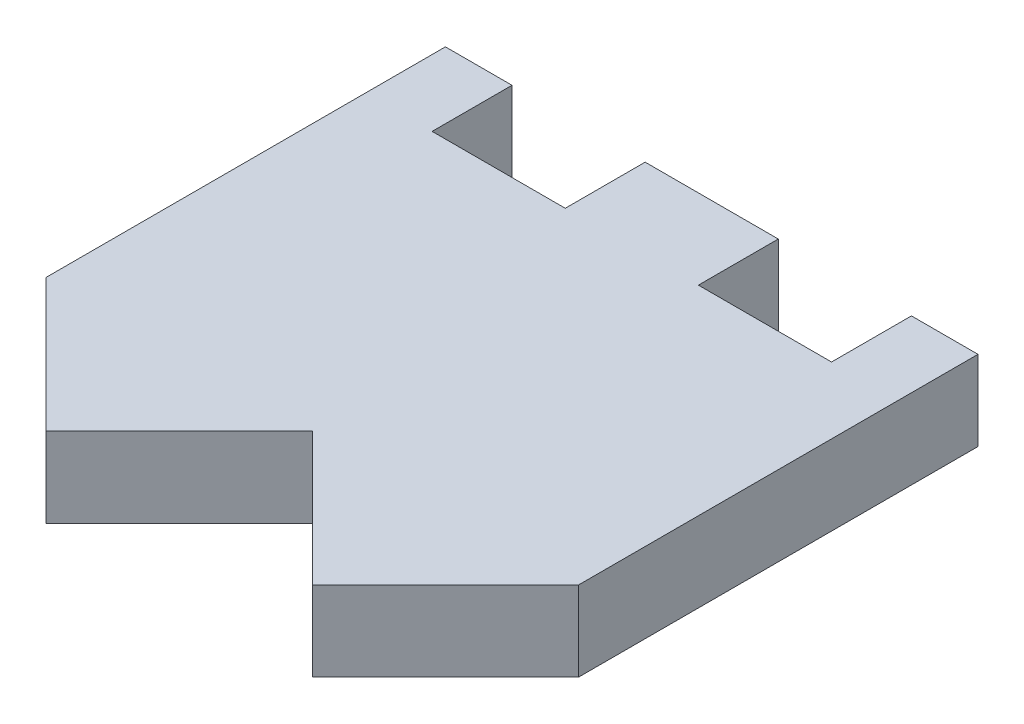
ISO-10303-21;
HEADER;
FILE_DESCRIPTION(('STEP AP214'),'2;1');
FILE_NAME('part.step','',(''),(''),'','','');
FILE_SCHEMA(('AUTOMOTIVE_DESIGN { 1 0 10303 214 1 1 1 1 }'));
ENDSEC;
DATA;
#1=APPLICATION_CONTEXT('core data for automotive mechanical design processes');
#2=APPLICATION_PROTOCOL_DEFINITION('international standard','automotive_design',2000,#1);
#3=PRODUCT_CONTEXT('',#1,'mechanical');
#4=PRODUCT('Part','Part','',(#3));
#5=PRODUCT_RELATED_PRODUCT_CATEGORY('part','',(#4));
#6=PRODUCT_DEFINITION_FORMATION('','',#4);
#7=PRODUCT_DEFINITION_CONTEXT('part definition',#1,'design');
#8=PRODUCT_DEFINITION('design','',#6,#7);
#9=PRODUCT_DEFINITION_SHAPE('','',#8);
#10=(LENGTH_UNIT() NAMED_UNIT(*) SI_UNIT(.MILLI.,.METRE.));
#11=(NAMED_UNIT(*) PLANE_ANGLE_UNIT() SI_UNIT($,.RADIAN.));
#12=(NAMED_UNIT(*) SI_UNIT($,.STERADIAN.) SOLID_ANGLE_UNIT());
#13=UNCERTAINTY_MEASURE_WITH_UNIT(LENGTH_MEASURE(1.E-05),#10,'distance_accuracy_value','');
#14=(GEOMETRIC_REPRESENTATION_CONTEXT(3) GLOBAL_UNCERTAINTY_ASSIGNED_CONTEXT((#13)) GLOBAL_UNIT_ASSIGNED_CONTEXT((#10,
#11,#12)) REPRESENTATION_CONTEXT('',''));
#15=CARTESIAN_POINT('',(0.,0.,0.));
#16=DIRECTION('',(0.,0.,1.));
#17=DIRECTION('',(1.,0.,0.));
#18=AXIS2_PLACEMENT_3D('',#15,#16,#17);
#19=CARTESIAN_POINT('',(0.,3.,0.));
#20=DIRECTION('',(0.,-1.,0.));
#21=DIRECTION('',(0.,0.,-1.));
#22=AXIS2_PLACEMENT_3D('',#19,#20,#21);
#23=PLANE('',#22);
#24=DIRECTION('',(0.,0.,-1.));
#25=VECTOR('',#24,1.);
#26=CARTESIAN_POINT('',(7.49999999999999,3.,0.));
#27=LINE('',#26,#25);
#28=CARTESIAN_POINT('',(7.5,3.,-7.));
#29=VERTEX_POINT('',#28);
#30=CARTESIAN_POINT('',(7.5,3.,-10.));
#31=VERTEX_POINT('',#30);
#32=EDGE_CURVE('E222',#29,#31,#27,.T.);
#33=ORIENTED_EDGE('',*,*,#32,.F.);
#34=DIRECTION('',(1.,0.,0.));
#35=VECTOR('',#34,1.);
#36=CARTESIAN_POINT('',(0.,3.,-7.));
#37=LINE('',#36,#35);
#38=CARTESIAN_POINT('',(2.5,3.,-7.));
#39=VERTEX_POINT('',#38);
#40=EDGE_CURVE('E322',#39,#29,#37,.T.);
#41=ORIENTED_EDGE('',*,*,#40,.F.);
#42=DIRECTION('',(0.,0.,1.));
#43=VECTOR('',#42,1.);
#44=CARTESIAN_POINT('',(2.5,3.,0.));
#45=LINE('',#44,#43);
#46=CARTESIAN_POINT('',(2.5,3.,-10.));
#47=VERTEX_POINT('',#46);
#48=EDGE_CURVE('E325',#47,#39,#45,.T.);
#49=ORIENTED_EDGE('',*,*,#48,.F.);
#50=DIRECTION('',(-1.,0.,0.));
#51=VECTOR('',#50,1.);
#52=CARTESIAN_POINT('',(-10.,3.,-10.));
#53=LINE('',#52,#51);
#54=CARTESIAN_POINT('',(-2.5,3.,-10.));
#55=VERTEX_POINT('',#54);
#56=EDGE_CURVE('E129',#47,#55,#53,.T.);
#57=ORIENTED_EDGE('',*,*,#56,.T.);
#58=DIRECTION('',(0.,0.,1.));
#59=VECTOR('',#58,1.);
#60=CARTESIAN_POINT('',(-2.5,3.,0.));
#61=LINE('',#60,#59);
#62=CARTESIAN_POINT('',(-2.5,3.,-7.));
#63=VERTEX_POINT('',#62);
#64=EDGE_CURVE('E300',#55,#63,#61,.T.);
#65=ORIENTED_EDGE('',*,*,#64,.T.);
#66=DIRECTION('',(-1.,0.,0.));
#67=VECTOR('',#66,1.);
#68=CARTESIAN_POINT('',(0.,3.,-7.));
#69=LINE('',#68,#67);
#70=CARTESIAN_POINT('',(-7.5,3.,-7.));
#71=VERTEX_POINT('',#70);
#72=EDGE_CURVE('E294',#63,#71,#69,.T.);
#73=ORIENTED_EDGE('',*,*,#72,.T.);
#74=DIRECTION('',(0.,0.,-1.));
#75=VECTOR('',#74,1.);
#76=CARTESIAN_POINT('',(-7.49999999999999,3.,0.));
#77=LINE('',#76,#75);
#78=CARTESIAN_POINT('',(-7.5,3.,-10.));
#79=VERTEX_POINT('',#78);
#80=EDGE_CURVE('E297',#71,#79,#77,.T.);
#81=ORIENTED_EDGE('',*,*,#80,.T.);
#82=CARTESIAN_POINT('',(-10.,3.,-10.));
#83=VERTEX_POINT('',#82);
#84=EDGE_CURVE('E264',#79,#83,#53,.T.);
#85=ORIENTED_EDGE('',*,*,#84,.T.);
#86=DIRECTION('',(0.,0.,1.));
#87=VECTOR('',#86,1.);
#88=CARTESIAN_POINT('',(-10.,3.,10.));
#89=LINE('',#88,#87);
#90=CARTESIAN_POINT('',(-10.,3.,4.99999999999999));
#91=VERTEX_POINT('',#90);
#92=EDGE_CURVE('E259',#83,#91,#89,.T.);
#93=ORIENTED_EDGE('',*,*,#92,.T.);
#94=DIRECTION('',(-0.707106781186548,0.,-0.707106781186548));
#95=VECTOR('',#94,1.);
#96=CARTESIAN_POINT('',(-7.5,3.,7.5));
#97=LINE('',#96,#95);
#98=CARTESIAN_POINT('',(-5.,3.,10.));
#99=VERTEX_POINT('',#98);
#100=EDGE_CURVE('E253',#99,#91,#97,.T.);
#101=ORIENTED_EDGE('',*,*,#100,.F.);
#102=DIRECTION('',(-0.707106781186547,0.,0.707106781186548));
#103=VECTOR('',#102,1.);
#104=CARTESIAN_POINT('',(2.5,3.,2.5));
#105=LINE('',#104,#103);
#106=CARTESIAN_POINT('',(0.,3.,5.));
#107=VERTEX_POINT('',#106);
#108=EDGE_CURVE('E283',#107,#99,#105,.T.);
#109=ORIENTED_EDGE('',*,*,#108,.F.);
#110=DIRECTION('',(-0.707106781186548,0.,-0.707106781186547));
#111=VECTOR('',#110,1.);
#112=CARTESIAN_POINT('',(-2.5,3.,2.5));
#113=LINE('',#112,#111);
#114=CARTESIAN_POINT('',(5.,3.,9.99999999999999));
#115=VERTEX_POINT('',#114);
#116=EDGE_CURVE('E274',#115,#107,#113,.T.);
#117=ORIENTED_EDGE('',*,*,#116,.F.);
#118=DIRECTION('',(-0.707106781186548,0.,0.707106781186548));
#119=VECTOR('',#118,1.);
#120=CARTESIAN_POINT('',(7.5,3.,7.5));
#121=LINE('',#120,#119);
#122=CARTESIAN_POINT('',(10.,3.,5.));
#123=VERTEX_POINT('',#122);
#124=EDGE_CURVE('E256',#123,#115,#121,.T.);
#125=ORIENTED_EDGE('',*,*,#124,.F.);
#126=DIRECTION('',(0.,0.,-1.));
#127=VECTOR('',#126,1.);
#128=CARTESIAN_POINT('',(10.,3.,10.));
#129=LINE('',#128,#127);
#130=CARTESIAN_POINT('',(10.,3.,-10.));
#131=VERTEX_POINT('',#130);
#132=EDGE_CURVE('E244',#123,#131,#129,.T.);
#133=ORIENTED_EDGE('',*,*,#132,.T.);
#134=EDGE_CURVE('E262',#131,#31,#53,.T.);
#135=ORIENTED_EDGE('',*,*,#134,.T.);
#136=EDGE_LOOP('',(#33,#41,#49,#57,#65,#73,#81,#85,#93,#101,#109,#117,#125,#133,#135));
#137=FACE_BOUND('',#136,.T.);
#138=ADVANCED_FACE('F106',(#137),#23,.F.);
#139=CARTESIAN_POINT('',(0.,0.,0.));
#140=DIRECTION('',(0.,-1.,0.));
#141=DIRECTION('',(0.,0.,-1.));
#142=AXIS2_PLACEMENT_3D('',#139,#140,#141);
#143=PLANE('',#142);
#144=DIRECTION('',(-1.,0.,0.));
#145=VECTOR('',#144,1.);
#146=CARTESIAN_POINT('',(7.5,0.,-7.));
#147=LINE('',#146,#145);
#148=CARTESIAN_POINT('',(7.5,0.,-7.));
#149=VERTEX_POINT('',#148);
#150=CARTESIAN_POINT('',(2.5,0.,-7.));
#151=VERTEX_POINT('',#150);
#152=EDGE_CURVE('E228',#149,#151,#147,.T.);
#153=ORIENTED_EDGE('',*,*,#152,.F.);
#154=DIRECTION('',(0.,0.,1.));
#155=VECTOR('',#154,1.);
#156=CARTESIAN_POINT('',(7.5,0.,-10.));
#157=LINE('',#156,#155);
#158=CARTESIAN_POINT('',(7.5,0.,-10.));
#159=VERTEX_POINT('',#158);
#160=EDGE_CURVE('E219',#159,#149,#157,.T.);
#161=ORIENTED_EDGE('',*,*,#160,.F.);
#162=DIRECTION('',(-1.,0.,0.));
#163=VECTOR('',#162,1.);
#164=CARTESIAN_POINT('',(-10.,0.,-10.));
#165=LINE('',#164,#163);
#166=CARTESIAN_POINT('',(10.,0.,-10.));
#167=VERTEX_POINT('',#166);
#168=EDGE_CURVE('E235',#167,#159,#165,.T.);
#169=ORIENTED_EDGE('',*,*,#168,.F.);
#170=DIRECTION('',(0.,0.,-1.));
#171=VECTOR('',#170,1.);
#172=CARTESIAN_POINT('',(10.,0.,10.));
#173=LINE('',#172,#171);
#174=CARTESIAN_POINT('',(10.,0.,5.));
#175=VERTEX_POINT('',#174);
#176=EDGE_CURVE('E247',#175,#167,#173,.T.);
#177=ORIENTED_EDGE('',*,*,#176,.F.);
#178=DIRECTION('',(0.707106781186548,0.,-0.707106781186548));
#179=VECTOR('',#178,1.);
#180=CARTESIAN_POINT('',(7.5,0.,7.5));
#181=LINE('',#180,#179);
#182=CARTESIAN_POINT('',(5.,0.,9.99999999999999));
#183=VERTEX_POINT('',#182);
#184=EDGE_CURVE('E272',#183,#175,#181,.T.);
#185=ORIENTED_EDGE('',*,*,#184,.F.);
#186=DIRECTION('',(0.707106781186548,0.,0.707106781186547));
#187=VECTOR('',#186,1.);
#188=CARTESIAN_POINT('',(-2.5,0.,2.5));
#189=LINE('',#188,#187);
#190=CARTESIAN_POINT('',(0.,0.,5.));
#191=VERTEX_POINT('',#190);
#192=EDGE_CURVE('E292',#191,#183,#189,.T.);
#193=ORIENTED_EDGE('',*,*,#192,.F.);
#194=DIRECTION('',(0.707106781186547,0.,-0.707106781186548));
#195=VECTOR('',#194,1.);
#196=CARTESIAN_POINT('',(2.5,0.,2.5));
#197=LINE('',#196,#195);
#198=CARTESIAN_POINT('',(-5.,0.,10.));
#199=VERTEX_POINT('',#198);
#200=EDGE_CURVE('E289',#199,#191,#197,.T.);
#201=ORIENTED_EDGE('',*,*,#200,.F.);
#202=DIRECTION('',(0.707106781186548,0.,0.707106781186548));
#203=VECTOR('',#202,1.);
#204=CARTESIAN_POINT('',(-7.5,0.,7.5));
#205=LINE('',#204,#203);
#206=CARTESIAN_POINT('',(-10.,0.,4.99999999999999));
#207=VERTEX_POINT('',#206);
#208=EDGE_CURVE('E271',#207,#199,#205,.T.);
#209=ORIENTED_EDGE('',*,*,#208,.F.);
#210=DIRECTION('',(0.,0.,1.));
#211=VECTOR('',#210,1.);
#212=CARTESIAN_POINT('',(-10.,0.,10.));
#213=LINE('',#212,#211);
#214=CARTESIAN_POINT('',(-10.,0.,-10.));
#215=VERTEX_POINT('',#214);
#216=EDGE_CURVE('E239',#215,#207,#213,.T.);
#217=ORIENTED_EDGE('',*,*,#216,.F.);
#218=CARTESIAN_POINT('',(-7.5,0.,-10.));
#219=VERTEX_POINT('',#218);
#220=EDGE_CURVE('E242',#219,#215,#165,.T.);
#221=ORIENTED_EDGE('',*,*,#220,.F.);
#222=DIRECTION('',(0.,0.,1.));
#223=VECTOR('',#222,1.);
#224=CARTESIAN_POINT('',(-7.5,0.,-10.));
#225=LINE('',#224,#223);
#226=CARTESIAN_POINT('',(-7.5,0.,-7.));
#227=VERTEX_POINT('',#226);
#228=EDGE_CURVE('E319',#219,#227,#225,.T.);
#229=ORIENTED_EDGE('',*,*,#228,.T.);
#230=DIRECTION('',(1.,0.,0.));
#231=VECTOR('',#230,1.);
#232=CARTESIAN_POINT('',(-7.5,0.,-7.));
#233=LINE('',#232,#231);
#234=CARTESIAN_POINT('',(-2.5,0.,-7.));
#235=VERTEX_POINT('',#234);
#236=EDGE_CURVE('E316',#227,#235,#233,.T.);
#237=ORIENTED_EDGE('',*,*,#236,.T.);
#238=DIRECTION('',(0.,0.,-1.));
#239=VECTOR('',#238,1.);
#240=CARTESIAN_POINT('',(-2.5,0.,-10.));
#241=LINE('',#240,#239);
#242=CARTESIAN_POINT('',(-2.5,0.,-10.));
#243=VERTEX_POINT('',#242);
#244=EDGE_CURVE('E307',#235,#243,#241,.T.);
#245=ORIENTED_EDGE('',*,*,#244,.T.);
#246=CARTESIAN_POINT('',(2.5,0.,-10.));
#247=VERTEX_POINT('',#246);
#248=EDGE_CURVE('E240',#247,#243,#165,.T.);
#249=ORIENTED_EDGE('',*,*,#248,.F.);
#250=DIRECTION('',(0.,0.,-1.));
#251=VECTOR('',#250,1.);
#252=CARTESIAN_POINT('',(2.5,0.,-10.));
#253=LINE('',#252,#251);
#254=EDGE_CURVE('E121',#151,#247,#253,.T.);
#255=ORIENTED_EDGE('',*,*,#254,.F.);
#256=EDGE_LOOP('',(#153,#161,#169,#177,#185,#193,#201,#209,#217,#221,#229,#237,#245,#249,#255));
#257=FACE_BOUND('',#256,.T.);
#258=ADVANCED_FACE('F233',(#257),#143,.T.);
#259=CARTESIAN_POINT('',(-10.,3.,-10.));
#260=DIRECTION('',(0.,0.,1.));
#261=DIRECTION('',(1.,0.,0.));
#262=AXIS2_PLACEMENT_3D('',#259,#260,#261);
#263=PLANE('',#262);
#264=DIRECTION('',(0.,1.,0.));
#265=VECTOR('',#264,1.);
#266=CARTESIAN_POINT('',(7.5,0.,-10.));
#267=LINE('',#266,#265);
#268=EDGE_CURVE('E215',#159,#31,#267,.T.);
#269=ORIENTED_EDGE('',*,*,#268,.T.);
#270=ORIENTED_EDGE('',*,*,#134,.F.);
#271=DIRECTION('',(0.,-1.,0.));
#272=VECTOR('',#271,1.);
#273=CARTESIAN_POINT('',(10.,3.,-10.));
#274=LINE('',#273,#272);
#275=EDGE_CURVE('E12',#131,#167,#274,.T.);
#276=ORIENTED_EDGE('',*,*,#275,.T.);
#277=ORIENTED_EDGE('',*,*,#168,.T.);
#278=EDGE_LOOP('',(#269,#270,#276,#277));
#279=FACE_BOUND('',#278,.T.);
#280=ADVANCED_FACE('F237',(#279),#263,.F.);
#281=DIRECTION('',(0.,1.,0.));
#282=VECTOR('',#281,1.);
#283=CARTESIAN_POINT('',(2.5,0.,-10.));
#284=LINE('',#283,#282);
#285=EDGE_CURVE('E227',#247,#47,#284,.T.);
#286=ORIENTED_EDGE('',*,*,#285,.F.);
#287=ORIENTED_EDGE('',*,*,#248,.T.);
#288=DIRECTION('',(0.,1.,0.));
#289=VECTOR('',#288,1.);
#290=CARTESIAN_POINT('',(-2.5,0.,-10.));
#291=LINE('',#290,#289);
#292=EDGE_CURVE('E310',#243,#55,#291,.T.);
#293=ORIENTED_EDGE('',*,*,#292,.T.);
#294=ORIENTED_EDGE('',*,*,#56,.F.);
#295=EDGE_LOOP('',(#286,#287,#293,#294));
#296=FACE_BOUND('',#295,.T.);
#297=ADVANCED_FACE('F342',(#296),#263,.F.);
#298=ORIENTED_EDGE('',*,*,#84,.F.);
#299=DIRECTION('',(0.,1.,0.));
#300=VECTOR('',#299,1.);
#301=CARTESIAN_POINT('',(-7.5,0.,-10.));
#302=LINE('',#301,#300);
#303=EDGE_CURVE('E302',#219,#79,#302,.T.);
#304=ORIENTED_EDGE('',*,*,#303,.F.);
#305=ORIENTED_EDGE('',*,*,#220,.T.);
#306=DIRECTION('',(0.,-1.,0.));
#307=VECTOR('',#306,1.);
#308=CARTESIAN_POINT('',(-10.,3.,-10.));
#309=LINE('',#308,#307);
#310=EDGE_CURVE('E114',#83,#215,#309,.T.);
#311=ORIENTED_EDGE('',*,*,#310,.F.);
#312=EDGE_LOOP('',(#298,#304,#305,#311));
#313=FACE_BOUND('',#312,.T.);
#314=ADVANCED_FACE('F351',(#313),#263,.F.);
#315=CARTESIAN_POINT('',(10.,3.,10.));
#316=DIRECTION('',(-1.,0.,0.));
#317=DIRECTION('',(0.,0.,1.));
#318=AXIS2_PLACEMENT_3D('',#315,#316,#317);
#319=PLANE('',#318);
#320=DIRECTION('',(0.,1.,0.));
#321=VECTOR('',#320,1.);
#322=CARTESIAN_POINT('',(10.,0.,5.));
#323=LINE('',#322,#321);
#324=EDGE_CURVE('E269',#175,#123,#323,.T.);
#325=ORIENTED_EDGE('',*,*,#324,.F.);
#326=ORIENTED_EDGE('',*,*,#176,.T.);
#327=ORIENTED_EDGE('',*,*,#275,.F.);
#328=ORIENTED_EDGE('',*,*,#132,.F.);
#329=EDGE_LOOP('',(#325,#326,#327,#328));
#330=FACE_BOUND('',#329,.T.);
#331=ADVANCED_FACE('F108',(#330),#319,.F.);
#332=CARTESIAN_POINT('',(-10.,3.,10.));
#333=DIRECTION('',(1.,0.,0.));
#334=DIRECTION('',(0.,0.,-1.));
#335=AXIS2_PLACEMENT_3D('',#332,#333,#334);
#336=PLANE('',#335);
#337=DIRECTION('',(0.,1.,0.));
#338=VECTOR('',#337,1.);
#339=CARTESIAN_POINT('',(-10.,0.,4.99999999999999));
#340=LINE('',#339,#338);
#341=EDGE_CURVE('E275',#207,#91,#340,.T.);
#342=ORIENTED_EDGE('',*,*,#341,.T.);
#343=ORIENTED_EDGE('',*,*,#92,.F.);
#344=ORIENTED_EDGE('',*,*,#310,.T.);
#345=ORIENTED_EDGE('',*,*,#216,.T.);
#346=EDGE_LOOP('',(#342,#343,#344,#345));
#347=FACE_BOUND('',#346,.T.);
#348=ADVANCED_FACE('F356',(#347),#336,.F.);
#349=CARTESIAN_POINT('',(7.5,0.,7.5));
#350=DIRECTION('',(0.707106781186547,0.,0.707106781186547));
#351=DIRECTION('',(0.707106781186548,0.,-0.707106781186548));
#352=AXIS2_PLACEMENT_3D('',#349,#350,#351);
#353=PLANE('',#352);
#354=ORIENTED_EDGE('',*,*,#124,.T.);
#355=DIRECTION('',(0.,1.,0.));
#356=VECTOR('',#355,1.);
#357=CARTESIAN_POINT('',(5.,0.,9.99999999999999));
#358=LINE('',#357,#356);
#359=EDGE_CURVE('E285',#183,#115,#358,.T.);
#360=ORIENTED_EDGE('',*,*,#359,.F.);
#361=ORIENTED_EDGE('',*,*,#184,.T.);
#362=ORIENTED_EDGE('',*,*,#324,.T.);
#363=EDGE_LOOP('',(#354,#360,#361,#362));
#364=FACE_BOUND('',#363,.T.);
#365=ADVANCED_FACE('F372',(#364),#353,.T.);
#366=CARTESIAN_POINT('',(-7.5,0.,7.5));
#367=DIRECTION('',(-0.707106781186547,0.,0.707106781186547));
#368=DIRECTION('',(0.707106781186548,0.,0.707106781186548));
#369=AXIS2_PLACEMENT_3D('',#366,#367,#368);
#370=PLANE('',#369);
#371=ORIENTED_EDGE('',*,*,#100,.T.);
#372=ORIENTED_EDGE('',*,*,#341,.F.);
#373=ORIENTED_EDGE('',*,*,#208,.T.);
#374=DIRECTION('',(0.,1.,0.));
#375=VECTOR('',#374,1.);
#376=CARTESIAN_POINT('',(-5.,0.,10.));
#377=LINE('',#376,#375);
#378=EDGE_CURVE('E268',#199,#99,#377,.T.);
#379=ORIENTED_EDGE('',*,*,#378,.T.);
#380=EDGE_LOOP('',(#371,#372,#373,#379));
#381=FACE_BOUND('',#380,.T.);
#382=ADVANCED_FACE('F362',(#381),#370,.T.);
#383=CARTESIAN_POINT('',(-2.5,0.,2.5));
#384=DIRECTION('',(-0.707106781186547,0.,0.707106781186548));
#385=DIRECTION('',(0.707106781186548,0.,0.707106781186547));
#386=AXIS2_PLACEMENT_3D('',#383,#384,#385);
#387=PLANE('',#386);
#388=ORIENTED_EDGE('',*,*,#116,.T.);
#389=DIRECTION('',(0.,1.,0.));
#390=VECTOR('',#389,1.);
#391=CARTESIAN_POINT('',(0.,0.,5.));
#392=LINE('',#391,#390);
#393=EDGE_CURVE('E286',#191,#107,#392,.T.);
#394=ORIENTED_EDGE('',*,*,#393,.F.);
#395=ORIENTED_EDGE('',*,*,#192,.T.);
#396=ORIENTED_EDGE('',*,*,#359,.T.);
#397=EDGE_LOOP('',(#388,#394,#395,#396));
#398=FACE_BOUND('',#397,.T.);
#399=ADVANCED_FACE('F370',(#398),#387,.T.);
#400=CARTESIAN_POINT('',(2.5,0.,2.5));
#401=DIRECTION('',(0.707106781186548,0.,0.707106781186547));
#402=DIRECTION('',(0.707106781186547,0.,-0.707106781186548));
#403=AXIS2_PLACEMENT_3D('',#400,#401,#402);
#404=PLANE('',#403);
#405=ORIENTED_EDGE('',*,*,#108,.T.);
#406=ORIENTED_EDGE('',*,*,#378,.F.);
#407=ORIENTED_EDGE('',*,*,#200,.T.);
#408=ORIENTED_EDGE('',*,*,#393,.T.);
#409=EDGE_LOOP('',(#405,#406,#407,#408));
#410=FACE_BOUND('',#409,.T.);
#411=ADVANCED_FACE('F364',(#410),#404,.T.);
#412=CARTESIAN_POINT('',(-7.5,0.,-7.));
#413=DIRECTION('',(0.,0.,1.));
#414=DIRECTION('',(1.,0.,0.));
#415=AXIS2_PLACEMENT_3D('',#412,#413,#414);
#416=PLANE('',#415);
#417=DIRECTION('',(0.,1.,0.));
#418=VECTOR('',#417,1.);
#419=CARTESIAN_POINT('',(-2.5,0.,-7.));
#420=LINE('',#419,#418);
#421=EDGE_CURVE('E306',#235,#63,#420,.T.);
#422=ORIENTED_EDGE('',*,*,#421,.F.);
#423=ORIENTED_EDGE('',*,*,#236,.F.);
#424=DIRECTION('',(0.,1.,0.));
#425=VECTOR('',#424,1.);
#426=CARTESIAN_POINT('',(-7.5,0.,-7.));
#427=LINE('',#426,#425);
#428=EDGE_CURVE('E303',#227,#71,#427,.T.);
#429=ORIENTED_EDGE('',*,*,#428,.T.);
#430=ORIENTED_EDGE('',*,*,#72,.F.);
#431=EDGE_LOOP('',(#422,#423,#429,#430));
#432=FACE_BOUND('',#431,.T.);
#433=ADVANCED_FACE('F347',(#432),#416,.F.);
#434=CARTESIAN_POINT('',(-7.5,0.,-10.));
#435=DIRECTION('',(-1.,0.,0.));
#436=DIRECTION('',(0.,0.,1.));
#437=AXIS2_PLACEMENT_3D('',#434,#435,#436);
#438=PLANE('',#437);
#439=ORIENTED_EDGE('',*,*,#428,.F.);
#440=ORIENTED_EDGE('',*,*,#228,.F.);
#441=ORIENTED_EDGE('',*,*,#303,.T.);
#442=ORIENTED_EDGE('',*,*,#80,.F.);
#443=EDGE_LOOP('',(#439,#440,#441,#442));
#444=FACE_BOUND('',#443,.T.);
#445=ADVANCED_FACE('F350',(#444),#438,.F.);
#446=CARTESIAN_POINT('',(-2.5,0.,-10.));
#447=DIRECTION('',(1.,0.,0.));
#448=DIRECTION('',(0.,0.,-1.));
#449=AXIS2_PLACEMENT_3D('',#446,#447,#448);
#450=PLANE('',#449);
#451=ORIENTED_EDGE('',*,*,#292,.F.);
#452=ORIENTED_EDGE('',*,*,#244,.F.);
#453=ORIENTED_EDGE('',*,*,#421,.T.);
#454=ORIENTED_EDGE('',*,*,#64,.F.);
#455=EDGE_LOOP('',(#451,#452,#453,#454));
#456=FACE_BOUND('',#455,.T.);
#457=ADVANCED_FACE('F344',(#456),#450,.F.);
#458=CARTESIAN_POINT('',(7.5,0.,-7.));
#459=DIRECTION('',(0.,0.,-1.));
#460=DIRECTION('',(-1.,0.,0.));
#461=AXIS2_PLACEMENT_3D('',#458,#459,#460);
#462=PLANE('',#461);
#463=ORIENTED_EDGE('',*,*,#40,.T.);
#464=DIRECTION('',(0.,1.,0.));
#465=VECTOR('',#464,1.);
#466=CARTESIAN_POINT('',(7.5,0.,-7.));
#467=LINE('',#466,#465);
#468=EDGE_CURVE('E326',#149,#29,#467,.T.);
#469=ORIENTED_EDGE('',*,*,#468,.F.);
#470=ORIENTED_EDGE('',*,*,#152,.T.);
#471=DIRECTION('',(0.,1.,0.));
#472=VECTOR('',#471,1.);
#473=CARTESIAN_POINT('',(2.5,0.,-7.));
#474=LINE('',#473,#472);
#475=EDGE_CURVE('E329',#151,#39,#474,.T.);
#476=ORIENTED_EDGE('',*,*,#475,.T.);
#477=EDGE_LOOP('',(#463,#469,#470,#476));
#478=FACE_BOUND('',#477,.T.);
#479=ADVANCED_FACE('F335',(#478),#462,.T.);
#480=CARTESIAN_POINT('',(7.5,0.,-10.));
#481=DIRECTION('',(-1.,0.,0.));
#482=DIRECTION('',(0.,0.,1.));
#483=AXIS2_PLACEMENT_3D('',#480,#481,#482);
#484=PLANE('',#483);
#485=ORIENTED_EDGE('',*,*,#32,.T.);
#486=ORIENTED_EDGE('',*,*,#268,.F.);
#487=ORIENTED_EDGE('',*,*,#160,.T.);
#488=ORIENTED_EDGE('',*,*,#468,.T.);
#489=EDGE_LOOP('',(#485,#486,#487,#488));
#490=FACE_BOUND('',#489,.T.);
#491=ADVANCED_FACE('F217',(#490),#484,.T.);
#492=CARTESIAN_POINT('',(2.5,0.,-10.));
#493=DIRECTION('',(1.,0.,0.));
#494=DIRECTION('',(0.,0.,-1.));
#495=AXIS2_PLACEMENT_3D('',#492,#493,#494);
#496=PLANE('',#495);
#497=ORIENTED_EDGE('',*,*,#48,.T.);
#498=ORIENTED_EDGE('',*,*,#475,.F.);
#499=ORIENTED_EDGE('',*,*,#254,.T.);
#500=ORIENTED_EDGE('',*,*,#285,.T.);
#501=EDGE_LOOP('',(#497,#498,#499,#500));
#502=FACE_BOUND('',#501,.T.);
#503=ADVANCED_FACE('F337',(#502),#496,.T.);
#504=CLOSED_SHELL('',(#138,#258,#280,#297,#314,#331,#348,#365,#382,#399,#411,#433,#445,#457,
#479,#491,#503));
#505=MANIFOLD_SOLID_BREP('B2',#504);
#506=ADVANCED_BREP_SHAPE_REPRESENTATION('',(#18,#505),#14);
#507=SHAPE_DEFINITION_REPRESENTATION(#9,#506);
ENDSEC;
END-ISO-10303-21;
